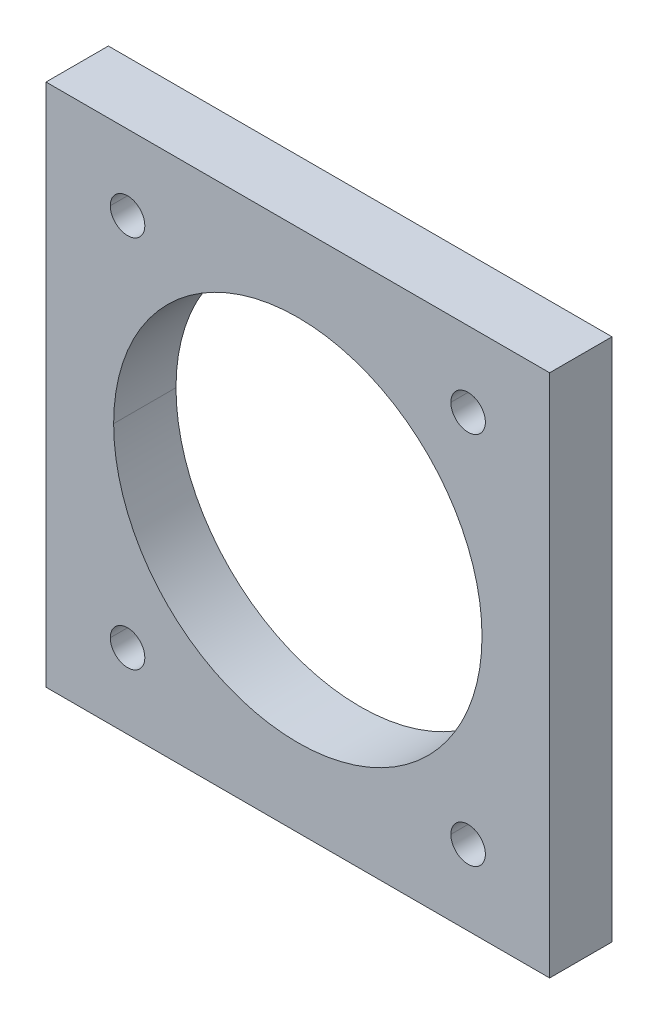
ISO-10303-21;
HEADER;
FILE_DESCRIPTION(('STEP AP214'),'2;1');
FILE_NAME('part.step','',(''),(''),'','','');
FILE_SCHEMA(('AUTOMOTIVE_DESIGN { 1 0 10303 214 1 1 1 1 }'));
ENDSEC;
DATA;
#1=APPLICATION_CONTEXT('core data for automotive mechanical design processes');
#2=APPLICATION_PROTOCOL_DEFINITION('international standard','automotive_design',2000,#1);
#3=PRODUCT_CONTEXT('',#1,'mechanical');
#4=PRODUCT('Part','Part','',(#3));
#5=PRODUCT_RELATED_PRODUCT_CATEGORY('part','',(#4));
#6=PRODUCT_DEFINITION_FORMATION('','',#4);
#7=PRODUCT_DEFINITION_CONTEXT('part definition',#1,'design');
#8=PRODUCT_DEFINITION('design','',#6,#7);
#9=PRODUCT_DEFINITION_SHAPE('','',#8);
#10=(LENGTH_UNIT() NAMED_UNIT(*) SI_UNIT(.MILLI.,.METRE.));
#11=(NAMED_UNIT(*) PLANE_ANGLE_UNIT() SI_UNIT($,.RADIAN.));
#12=(NAMED_UNIT(*) SI_UNIT($,.STERADIAN.) SOLID_ANGLE_UNIT());
#13=UNCERTAINTY_MEASURE_WITH_UNIT(LENGTH_MEASURE(1.E-05),#10,'distance_accuracy_value','');
#14=(GEOMETRIC_REPRESENTATION_CONTEXT(3) GLOBAL_UNCERTAINTY_ASSIGNED_CONTEXT((#13)) GLOBAL_UNIT_ASSIGNED_CONTEXT((#10,
#11,#12)) REPRESENTATION_CONTEXT('',''));
#15=CARTESIAN_POINT('',(0.,0.,0.));
#16=DIRECTION('',(0.,0.,1.));
#17=DIRECTION('',(1.,0.,0.));
#18=AXIS2_PLACEMENT_3D('',#15,#16,#17);
#19=CARTESIAN_POINT('',(0.,0.,0.));
#20=DIRECTION('',(0.,0.,1.));
#21=DIRECTION('',(1.,0.,0.));
#22=AXIS2_PLACEMENT_3D('',#19,#20,#21);
#23=PLANE('',#22);
#24=DIRECTION('',(0.,-1.,0.));
#25=VECTOR('',#24,1.);
#26=CARTESIAN_POINT('',(0.,1387.856,0.));
#27=LINE('',#26,#25);
#28=CARTESIAN_POINT('',(0.,1387.856,0.));
#29=VERTEX_POINT('',#28);
#30=CARTESIAN_POINT('',(0.,0.,0.));
#31=VERTEX_POINT('',#30);
#32=EDGE_CURVE('E27',#29,#31,#27,.T.);
#33=ORIENTED_EDGE('',*,*,#32,.F.);
#34=DIRECTION('',(-1.,0.,0.));
#35=VECTOR('',#34,1.);
#36=CARTESIAN_POINT('',(1333.5,1387.856,0.));
#37=LINE('',#36,#35);
#38=CARTESIAN_POINT('',(1333.5,1387.856,0.));
#39=VERTEX_POINT('',#38);
#40=EDGE_CURVE('E36',#39,#29,#37,.T.);
#41=ORIENTED_EDGE('',*,*,#40,.F.);
#42=DIRECTION('',(0.,1.,0.));
#43=VECTOR('',#42,1.);
#44=CARTESIAN_POINT('',(1333.5,0.,0.));
#45=LINE('',#44,#43);
#46=CARTESIAN_POINT('',(1333.5,0.,0.));
#47=VERTEX_POINT('',#46);
#48=EDGE_CURVE('E219',#47,#39,#45,.T.);
#49=ORIENTED_EDGE('',*,*,#48,.F.);
#50=DIRECTION('',(1.,0.,0.));
#51=VECTOR('',#50,1.);
#52=CARTESIAN_POINT('',(0.,0.,0.));
#53=LINE('',#52,#51);
#54=EDGE_CURVE('E163',#31,#47,#53,.T.);
#55=ORIENTED_EDGE('',*,*,#54,.F.);
#56=EDGE_LOOP('',(#33,#41,#49,#55));
#57=FACE_BOUND('',#56,.T.);
#58=CARTESIAN_POINT('',(215.9,198.628,0.));
#59=DIRECTION('',(0.,0.,-1.));
#60=DIRECTION('',(-1.,0.,0.));
#61=AXIS2_PLACEMENT_3D('',#58,#59,#60);
#62=CIRCLE('',#61,45.72);
#63=CARTESIAN_POINT('',(170.18,198.628,0.));
#64=VERTEX_POINT('',#63);
#65=CARTESIAN_POINT('',(261.62,198.628,0.));
#66=VERTEX_POINT('',#65);
#67=EDGE_CURVE('E164',#64,#66,#62,.T.);
#68=ORIENTED_EDGE('',*,*,#67,.F.);
#69=CARTESIAN_POINT('',(215.9,198.628,0.));
#70=DIRECTION('',(0.,0.,-1.));
#71=DIRECTION('',(1.,0.,0.));
#72=AXIS2_PLACEMENT_3D('',#69,#70,#71);
#73=CIRCLE('',#72,45.72);
#74=EDGE_CURVE('E194',#66,#64,#73,.T.);
#75=ORIENTED_EDGE('',*,*,#74,.F.);
#76=EDGE_LOOP('',(#68,#75));
#77=FACE_BOUND('',#76,.T.);
#78=CARTESIAN_POINT('',(1117.6,198.628,0.));
#79=DIRECTION('',(0.,0.,-1.));
#80=DIRECTION('',(-1.,0.,0.));
#81=AXIS2_PLACEMENT_3D('',#78,#79,#80);
#82=CIRCLE('',#81,45.72);
#83=CARTESIAN_POINT('',(1071.88,198.628,0.));
#84=VERTEX_POINT('',#83);
#85=CARTESIAN_POINT('',(1163.32,198.628,0.));
#86=VERTEX_POINT('',#85);
#87=EDGE_CURVE('E154',#84,#86,#82,.T.);
#88=ORIENTED_EDGE('',*,*,#87,.F.);
#89=CARTESIAN_POINT('',(1117.6,198.628,0.));
#90=DIRECTION('',(0.,0.,-1.));
#91=DIRECTION('',(1.,0.,0.));
#92=AXIS2_PLACEMENT_3D('',#89,#90,#91);
#93=CIRCLE('',#92,45.72);
#94=EDGE_CURVE('E197',#86,#84,#93,.T.);
#95=ORIENTED_EDGE('',*,*,#94,.F.);
#96=EDGE_LOOP('',(#88,#95));
#97=FACE_BOUND('',#96,.T.);
#98=CARTESIAN_POINT('',(1117.6,1189.228,0.));
#99=DIRECTION('',(0.,0.,-1.));
#100=DIRECTION('',(-1.,0.,0.));
#101=AXIS2_PLACEMENT_3D('',#98,#99,#100);
#102=CIRCLE('',#101,45.72);
#103=CARTESIAN_POINT('',(1071.88,1189.228,0.));
#104=VERTEX_POINT('',#103);
#105=CARTESIAN_POINT('',(1163.32,1189.228,0.));
#106=VERTEX_POINT('',#105);
#107=EDGE_CURVE('E177',#104,#106,#102,.T.);
#108=ORIENTED_EDGE('',*,*,#107,.F.);
#109=CARTESIAN_POINT('',(1117.6,1189.228,0.));
#110=DIRECTION('',(0.,0.,-1.));
#111=DIRECTION('',(1.,0.,0.));
#112=AXIS2_PLACEMENT_3D('',#109,#110,#111);
#113=CIRCLE('',#112,45.72);
#114=EDGE_CURVE('E126',#106,#104,#113,.T.);
#115=ORIENTED_EDGE('',*,*,#114,.F.);
#116=EDGE_LOOP('',(#108,#115));
#117=FACE_BOUND('',#116,.T.);
#118=CARTESIAN_POINT('',(215.9,1189.228,0.));
#119=DIRECTION('',(0.,0.,-1.));
#120=DIRECTION('',(-1.,0.,0.));
#121=AXIS2_PLACEMENT_3D('',#118,#119,#120);
#122=CIRCLE('',#121,45.72);
#123=CARTESIAN_POINT('',(170.18,1189.228,0.));
#124=VERTEX_POINT('',#123);
#125=CARTESIAN_POINT('',(261.62,1189.228,0.));
#126=VERTEX_POINT('',#125);
#127=EDGE_CURVE('E107',#124,#126,#122,.T.);
#128=ORIENTED_EDGE('',*,*,#127,.F.);
#129=CARTESIAN_POINT('',(215.9,1189.228,0.));
#130=DIRECTION('',(0.,0.,-1.));
#131=DIRECTION('',(1.,0.,0.));
#132=AXIS2_PLACEMENT_3D('',#129,#130,#131);
#133=CIRCLE('',#132,45.72);
#134=EDGE_CURVE('E104',#126,#124,#133,.T.);
#135=ORIENTED_EDGE('',*,*,#134,.F.);
#136=EDGE_LOOP('',(#128,#135));
#137=FACE_BOUND('',#136,.T.);
#138=CARTESIAN_POINT('',(666.75,693.928,0.));
#139=DIRECTION('',(0.,0.,-1.));
#140=DIRECTION('',(-1.,0.,0.));
#141=AXIS2_PLACEMENT_3D('',#138,#139,#140);
#142=CIRCLE('',#141,487.68);
#143=CARTESIAN_POINT('',(179.07,693.928,0.));
#144=VERTEX_POINT('',#143);
#145=CARTESIAN_POINT('',(1154.43,693.928,0.));
#146=VERTEX_POINT('',#145);
#147=EDGE_CURVE('E149',#144,#146,#142,.T.);
#148=ORIENTED_EDGE('',*,*,#147,.F.);
#149=CARTESIAN_POINT('',(666.75,693.928,0.));
#150=DIRECTION('',(0.,0.,-1.));
#151=DIRECTION('',(1.,0.,0.));
#152=AXIS2_PLACEMENT_3D('',#149,#150,#151);
#153=CIRCLE('',#152,487.68);
#154=EDGE_CURVE('E189',#146,#144,#153,.T.);
#155=ORIENTED_EDGE('',*,*,#154,.F.);
#156=EDGE_LOOP('',(#148,#155));
#157=FACE_BOUND('',#156,.T.);
#158=ADVANCED_FACE('F16',(#57,#77,#97,#117,#137,#157),#23,.F.);
#159=CARTESIAN_POINT('',(0.,1387.856,0.));
#160=DIRECTION('',(-1.,0.,0.));
#161=DIRECTION('',(0.,-1.,0.));
#162=AXIS2_PLACEMENT_3D('',#159,#160,#161);
#163=PLANE('',#162);
#164=DIRECTION('',(0.,0.,1.));
#165=VECTOR('',#164,1.);
#166=CARTESIAN_POINT('',(0.,0.,0.));
#167=LINE('',#166,#165);
#168=CARTESIAN_POINT('',(0.,0.,165.1));
#169=VERTEX_POINT('',#168);
#170=EDGE_CURVE('E10',#31,#169,#167,.T.);
#171=ORIENTED_EDGE('',*,*,#170,.T.);
#172=DIRECTION('',(0.,-1.,0.));
#173=VECTOR('',#172,1.);
#174=CARTESIAN_POINT('',(0.,1387.856,165.1));
#175=LINE('',#174,#173);
#176=CARTESIAN_POINT('',(0.,1387.856,165.1));
#177=VERTEX_POINT('',#176);
#178=EDGE_CURVE('E211',#177,#169,#175,.T.);
#179=ORIENTED_EDGE('',*,*,#178,.F.);
#180=DIRECTION('',(0.,0.,1.));
#181=VECTOR('',#180,1.);
#182=CARTESIAN_POINT('',(0.,1387.856,0.));
#183=LINE('',#182,#181);
#184=EDGE_CURVE('E144',#29,#177,#183,.T.);
#185=ORIENTED_EDGE('',*,*,#184,.F.);
#186=ORIENTED_EDGE('',*,*,#32,.T.);
#187=EDGE_LOOP('',(#171,#179,#185,#186));
#188=FACE_BOUND('',#187,.T.);
#189=ADVANCED_FACE('F302',(#188),#163,.T.);
#190=CARTESIAN_POINT('',(1333.5,1387.856,0.));
#191=DIRECTION('',(0.,1.,0.));
#192=DIRECTION('',(-1.,0.,0.));
#193=AXIS2_PLACEMENT_3D('',#190,#191,#192);
#194=PLANE('',#193);
#195=ORIENTED_EDGE('',*,*,#184,.T.);
#196=DIRECTION('',(-1.,0.,0.));
#197=VECTOR('',#196,1.);
#198=CARTESIAN_POINT('',(1333.5,1387.856,165.1));
#199=LINE('',#198,#197);
#200=CARTESIAN_POINT('',(1333.5,1387.856,165.1));
#201=VERTEX_POINT('',#200);
#202=EDGE_CURVE('E207',#201,#177,#199,.T.);
#203=ORIENTED_EDGE('',*,*,#202,.F.);
#204=DIRECTION('',(0.,0.,1.));
#205=VECTOR('',#204,1.);
#206=CARTESIAN_POINT('',(1333.5,1387.856,0.));
#207=LINE('',#206,#205);
#208=EDGE_CURVE('E20',#39,#201,#207,.T.);
#209=ORIENTED_EDGE('',*,*,#208,.F.);
#210=ORIENTED_EDGE('',*,*,#40,.T.);
#211=EDGE_LOOP('',(#195,#203,#209,#210));
#212=FACE_BOUND('',#211,.T.);
#213=ADVANCED_FACE('F305',(#212),#194,.T.);
#214=CARTESIAN_POINT('',(1333.5,0.,0.));
#215=DIRECTION('',(1.,0.,0.));
#216=DIRECTION('',(0.,1.,0.));
#217=AXIS2_PLACEMENT_3D('',#214,#215,#216);
#218=PLANE('',#217);
#219=ORIENTED_EDGE('',*,*,#208,.T.);
#220=DIRECTION('',(0.,1.,0.));
#221=VECTOR('',#220,1.);
#222=CARTESIAN_POINT('',(1333.5,0.,165.1));
#223=LINE('',#222,#221);
#224=CARTESIAN_POINT('',(1333.5,0.,165.1));
#225=VERTEX_POINT('',#224);
#226=EDGE_CURVE('E206',#225,#201,#223,.T.);
#227=ORIENTED_EDGE('',*,*,#226,.F.);
#228=DIRECTION('',(0.,0.,1.));
#229=VECTOR('',#228,1.);
#230=CARTESIAN_POINT('',(1333.5,0.,0.));
#231=LINE('',#230,#229);
#232=EDGE_CURVE('E215',#47,#225,#231,.T.);
#233=ORIENTED_EDGE('',*,*,#232,.F.);
#234=ORIENTED_EDGE('',*,*,#48,.T.);
#235=EDGE_LOOP('',(#219,#227,#233,#234));
#236=FACE_BOUND('',#235,.T.);
#237=ADVANCED_FACE('F306',(#236),#218,.T.);
#238=CARTESIAN_POINT('',(0.,0.,0.));
#239=DIRECTION('',(0.,-1.,0.));
#240=DIRECTION('',(1.,0.,0.));
#241=AXIS2_PLACEMENT_3D('',#238,#239,#240);
#242=PLANE('',#241);
#243=ORIENTED_EDGE('',*,*,#232,.T.);
#244=DIRECTION('',(1.,0.,0.));
#245=VECTOR('',#244,1.);
#246=CARTESIAN_POINT('',(0.,0.,165.1));
#247=LINE('',#246,#245);
#248=EDGE_CURVE('E247',#169,#225,#247,.T.);
#249=ORIENTED_EDGE('',*,*,#248,.F.);
#250=ORIENTED_EDGE('',*,*,#170,.F.);
#251=ORIENTED_EDGE('',*,*,#54,.T.);
#252=EDGE_LOOP('',(#243,#249,#250,#251));
#253=FACE_BOUND('',#252,.T.);
#254=ADVANCED_FACE('F308',(#253),#242,.T.);
#255=CARTESIAN_POINT('',(215.9,198.628,0.));
#256=DIRECTION('',(0.,0.,-1.));
#257=DIRECTION('',(1.,0.,0.));
#258=AXIS2_PLACEMENT_3D('',#255,#256,#257);
#259=CYLINDRICAL_SURFACE('',#258,45.72);
#260=DIRECTION('',(0.,0.,1.));
#261=VECTOR('',#260,1.);
#262=CARTESIAN_POINT('',(261.62,198.628,0.));
#263=LINE('',#262,#261);
#264=CARTESIAN_POINT('',(261.62,198.628,165.1));
#265=VERTEX_POINT('',#264);
#266=EDGE_CURVE('E160',#66,#265,#263,.T.);
#267=ORIENTED_EDGE('',*,*,#266,.T.);
#268=CARTESIAN_POINT('',(215.9,198.628,165.1));
#269=DIRECTION('',(0.,0.,-1.));
#270=DIRECTION('',(-1.,0.,0.));
#271=AXIS2_PLACEMENT_3D('',#268,#269,#270);
#272=CIRCLE('',#271,45.72);
#273=CARTESIAN_POINT('',(170.18,198.628,165.1));
#274=VERTEX_POINT('',#273);
#275=EDGE_CURVE('E90',#274,#265,#272,.T.);
#276=ORIENTED_EDGE('',*,*,#275,.F.);
#277=DIRECTION('',(0.,0.,1.));
#278=VECTOR('',#277,1.);
#279=CARTESIAN_POINT('',(170.18,198.628,0.));
#280=LINE('',#279,#278);
#281=EDGE_CURVE('E138',#64,#274,#280,.T.);
#282=ORIENTED_EDGE('',*,*,#281,.F.);
#283=ORIENTED_EDGE('',*,*,#67,.T.);
#284=EDGE_LOOP('',(#267,#276,#282,#283));
#285=FACE_BOUND('',#284,.T.);
#286=ADVANCED_FACE('F349',(#285),#259,.F.);
#287=CARTESIAN_POINT('',(215.9,198.628,0.));
#288=DIRECTION('',(0.,0.,-1.));
#289=DIRECTION('',(1.,0.,0.));
#290=AXIS2_PLACEMENT_3D('',#287,#288,#289);
#291=CYLINDRICAL_SURFACE('',#290,45.72);
#292=ORIENTED_EDGE('',*,*,#281,.T.);
#293=CARTESIAN_POINT('',(215.9,198.628,165.1));
#294=DIRECTION('',(0.,0.,-1.));
#295=DIRECTION('',(1.,0.,0.));
#296=AXIS2_PLACEMENT_3D('',#293,#294,#295);
#297=CIRCLE('',#296,45.72);
#298=EDGE_CURVE('E165',#265,#274,#297,.T.);
#299=ORIENTED_EDGE('',*,*,#298,.F.);
#300=ORIENTED_EDGE('',*,*,#266,.F.);
#301=ORIENTED_EDGE('',*,*,#74,.T.);
#302=EDGE_LOOP('',(#292,#299,#300,#301));
#303=FACE_BOUND('',#302,.T.);
#304=ADVANCED_FACE('F269',(#303),#291,.F.);
#305=CARTESIAN_POINT('',(1117.6,198.628,0.));
#306=DIRECTION('',(0.,0.,-1.));
#307=DIRECTION('',(1.,0.,0.));
#308=AXIS2_PLACEMENT_3D('',#305,#306,#307);
#309=CYLINDRICAL_SURFACE('',#308,45.72);
#310=DIRECTION('',(0.,0.,1.));
#311=VECTOR('',#310,1.);
#312=CARTESIAN_POINT('',(1163.32,198.628,0.));
#313=LINE('',#312,#311);
#314=CARTESIAN_POINT('',(1163.32,198.628,165.1));
#315=VERTEX_POINT('',#314);
#316=EDGE_CURVE('E158',#86,#315,#313,.T.);
#317=ORIENTED_EDGE('',*,*,#316,.T.);
#318=CARTESIAN_POINT('',(1117.6,198.628,165.1));
#319=DIRECTION('',(0.,0.,-1.));
#320=DIRECTION('',(-1.,0.,0.));
#321=AXIS2_PLACEMENT_3D('',#318,#319,#320);
#322=CIRCLE('',#321,45.72);
#323=CARTESIAN_POINT('',(1071.88,198.628,165.1));
#324=VERTEX_POINT('',#323);
#325=EDGE_CURVE('E168',#324,#315,#322,.T.);
#326=ORIENTED_EDGE('',*,*,#325,.F.);
#327=DIRECTION('',(0.,0.,1.));
#328=VECTOR('',#327,1.);
#329=CARTESIAN_POINT('',(1071.88,198.628,0.));
#330=LINE('',#329,#328);
#331=EDGE_CURVE('E159',#84,#324,#330,.T.);
#332=ORIENTED_EDGE('',*,*,#331,.F.);
#333=ORIENTED_EDGE('',*,*,#87,.T.);
#334=EDGE_LOOP('',(#317,#326,#332,#333));
#335=FACE_BOUND('',#334,.T.);
#336=ADVANCED_FACE('F343',(#335),#309,.F.);
#337=CARTESIAN_POINT('',(1117.6,198.628,0.));
#338=DIRECTION('',(0.,0.,-1.));
#339=DIRECTION('',(1.,0.,0.));
#340=AXIS2_PLACEMENT_3D('',#337,#338,#339);
#341=CYLINDRICAL_SURFACE('',#340,45.72);
#342=ORIENTED_EDGE('',*,*,#331,.T.);
#343=CARTESIAN_POINT('',(1117.6,198.628,165.1));
#344=DIRECTION('',(0.,0.,-1.));
#345=DIRECTION('',(1.,0.,0.));
#346=AXIS2_PLACEMENT_3D('',#343,#344,#345);
#347=CIRCLE('',#346,45.72);
#348=EDGE_CURVE('E169',#315,#324,#347,.T.);
#349=ORIENTED_EDGE('',*,*,#348,.F.);
#350=ORIENTED_EDGE('',*,*,#316,.F.);
#351=ORIENTED_EDGE('',*,*,#94,.T.);
#352=EDGE_LOOP('',(#342,#349,#350,#351));
#353=FACE_BOUND('',#352,.T.);
#354=ADVANCED_FACE('F18',(#353),#341,.F.);
#355=CARTESIAN_POINT('',(1117.6,1189.228,0.));
#356=DIRECTION('',(0.,0.,-1.));
#357=DIRECTION('',(1.,0.,0.));
#358=AXIS2_PLACEMENT_3D('',#355,#356,#357);
#359=CYLINDRICAL_SURFACE('',#358,45.72);
#360=DIRECTION('',(0.,0.,1.));
#361=VECTOR('',#360,1.);
#362=CARTESIAN_POINT('',(1163.32,1189.228,0.));
#363=LINE('',#362,#361);
#364=CARTESIAN_POINT('',(1163.32,1189.228,165.1));
#365=VERTEX_POINT('',#364);
#366=EDGE_CURVE('E181',#106,#365,#363,.T.);
#367=ORIENTED_EDGE('',*,*,#366,.T.);
#368=CARTESIAN_POINT('',(1117.6,1189.228,165.1));
#369=DIRECTION('',(0.,0.,-1.));
#370=DIRECTION('',(-1.,0.,0.));
#371=AXIS2_PLACEMENT_3D('',#368,#369,#370);
#372=CIRCLE('',#371,45.72);
#373=CARTESIAN_POINT('',(1071.88,1189.228,165.1));
#374=VERTEX_POINT('',#373);
#375=EDGE_CURVE('E173',#374,#365,#372,.T.);
#376=ORIENTED_EDGE('',*,*,#375,.F.);
#377=DIRECTION('',(0.,0.,1.));
#378=VECTOR('',#377,1.);
#379=CARTESIAN_POINT('',(1071.88,1189.228,0.));
#380=LINE('',#379,#378);
#381=EDGE_CURVE('E134',#104,#374,#380,.T.);
#382=ORIENTED_EDGE('',*,*,#381,.F.);
#383=ORIENTED_EDGE('',*,*,#107,.T.);
#384=EDGE_LOOP('',(#367,#376,#382,#383));
#385=FACE_BOUND('',#384,.T.);
#386=ADVANCED_FACE('F324',(#385),#359,.F.);
#387=CARTESIAN_POINT('',(1117.6,1189.228,0.));
#388=DIRECTION('',(0.,0.,-1.));
#389=DIRECTION('',(1.,0.,0.));
#390=AXIS2_PLACEMENT_3D('',#387,#388,#389);
#391=CYLINDRICAL_SURFACE('',#390,45.72);
#392=ORIENTED_EDGE('',*,*,#381,.T.);
#393=CARTESIAN_POINT('',(1117.6,1189.228,165.1));
#394=DIRECTION('',(0.,0.,-1.));
#395=DIRECTION('',(1.,0.,0.));
#396=AXIS2_PLACEMENT_3D('',#393,#394,#395);
#397=CIRCLE('',#396,45.72);
#398=EDGE_CURVE('E143',#365,#374,#397,.T.);
#399=ORIENTED_EDGE('',*,*,#398,.F.);
#400=ORIENTED_EDGE('',*,*,#366,.F.);
#401=ORIENTED_EDGE('',*,*,#114,.T.);
#402=EDGE_LOOP('',(#392,#399,#400,#401));
#403=FACE_BOUND('',#402,.T.);
#404=ADVANCED_FACE('F330',(#403),#391,.F.);
#405=CARTESIAN_POINT('',(215.9,1189.228,0.));
#406=DIRECTION('',(0.,0.,-1.));
#407=DIRECTION('',(1.,0.,0.));
#408=AXIS2_PLACEMENT_3D('',#405,#406,#407);
#409=CYLINDRICAL_SURFACE('',#408,45.72);
#410=DIRECTION('',(0.,0.,1.));
#411=VECTOR('',#410,1.);
#412=CARTESIAN_POINT('',(261.62,1189.228,0.));
#413=LINE('',#412,#411);
#414=CARTESIAN_POINT('',(261.62,1189.228,165.1));
#415=VERTEX_POINT('',#414);
#416=EDGE_CURVE('E119',#126,#415,#413,.T.);
#417=ORIENTED_EDGE('',*,*,#416,.T.);
#418=CARTESIAN_POINT('',(215.9,1189.228,165.1));
#419=DIRECTION('',(0.,0.,-1.));
#420=DIRECTION('',(-1.,0.,0.));
#421=AXIS2_PLACEMENT_3D('',#418,#419,#420);
#422=CIRCLE('',#421,45.72);
#423=CARTESIAN_POINT('',(170.18,1189.228,165.1));
#424=VERTEX_POINT('',#423);
#425=EDGE_CURVE('E140',#424,#415,#422,.T.);
#426=ORIENTED_EDGE('',*,*,#425,.F.);
#427=DIRECTION('',(0.,0.,1.));
#428=VECTOR('',#427,1.);
#429=CARTESIAN_POINT('',(170.18,1189.228,0.));
#430=LINE('',#429,#428);
#431=EDGE_CURVE('E113',#124,#424,#430,.T.);
#432=ORIENTED_EDGE('',*,*,#431,.F.);
#433=ORIENTED_EDGE('',*,*,#127,.T.);
#434=EDGE_LOOP('',(#417,#426,#432,#433));
#435=FACE_BOUND('',#434,.T.);
#436=ADVANCED_FACE('F118',(#435),#409,.F.);
#437=CARTESIAN_POINT('',(215.9,1189.228,0.));
#438=DIRECTION('',(0.,0.,-1.));
#439=DIRECTION('',(1.,0.,0.));
#440=AXIS2_PLACEMENT_3D('',#437,#438,#439);
#441=CYLINDRICAL_SURFACE('',#440,45.72);
#442=ORIENTED_EDGE('',*,*,#431,.T.);
#443=CARTESIAN_POINT('',(215.9,1189.228,165.1));
#444=DIRECTION('',(0.,0.,-1.));
#445=DIRECTION('',(1.,0.,0.));
#446=AXIS2_PLACEMENT_3D('',#443,#444,#445);
#447=CIRCLE('',#446,45.72);
#448=EDGE_CURVE('E124',#415,#424,#447,.T.);
#449=ORIENTED_EDGE('',*,*,#448,.F.);
#450=ORIENTED_EDGE('',*,*,#416,.F.);
#451=ORIENTED_EDGE('',*,*,#134,.T.);
#452=EDGE_LOOP('',(#442,#449,#450,#451));
#453=FACE_BOUND('',#452,.T.);
#454=ADVANCED_FACE('F122',(#453),#441,.F.);
#455=CARTESIAN_POINT('',(666.75,693.928,0.));
#456=DIRECTION('',(0.,0.,-1.));
#457=DIRECTION('',(1.,0.,0.));
#458=AXIS2_PLACEMENT_3D('',#455,#456,#457);
#459=CYLINDRICAL_SURFACE('',#458,487.68);
#460=DIRECTION('',(0.,0.,1.));
#461=VECTOR('',#460,1.);
#462=CARTESIAN_POINT('',(1154.43,693.928,0.));
#463=LINE('',#462,#461);
#464=CARTESIAN_POINT('',(1154.43,693.928,165.1));
#465=VERTEX_POINT('',#464);
#466=EDGE_CURVE('E114',#146,#465,#463,.T.);
#467=ORIENTED_EDGE('',*,*,#466,.T.);
#468=CARTESIAN_POINT('',(666.75,693.928,165.1));
#469=DIRECTION('',(0.,0.,-1.));
#470=DIRECTION('',(-1.,0.,0.));
#471=AXIS2_PLACEMENT_3D('',#468,#469,#470);
#472=CIRCLE('',#471,487.68);
#473=CARTESIAN_POINT('',(179.07,693.928,165.1));
#474=VERTEX_POINT('',#473);
#475=EDGE_CURVE('E184',#474,#465,#472,.T.);
#476=ORIENTED_EDGE('',*,*,#475,.F.);
#477=DIRECTION('',(0.,0.,1.));
#478=VECTOR('',#477,1.);
#479=CARTESIAN_POINT('',(179.07,693.928,0.));
#480=LINE('',#479,#478);
#481=EDGE_CURVE('E185',#144,#474,#480,.T.);
#482=ORIENTED_EDGE('',*,*,#481,.F.);
#483=ORIENTED_EDGE('',*,*,#147,.T.);
#484=EDGE_LOOP('',(#467,#476,#482,#483));
#485=FACE_BOUND('',#484,.T.);
#486=ADVANCED_FACE('F286',(#485),#459,.F.);
#487=CARTESIAN_POINT('',(666.75,693.928,0.));
#488=DIRECTION('',(0.,0.,-1.));
#489=DIRECTION('',(1.,0.,0.));
#490=AXIS2_PLACEMENT_3D('',#487,#488,#489);
#491=CYLINDRICAL_SURFACE('',#490,487.68);
#492=ORIENTED_EDGE('',*,*,#481,.T.);
#493=CARTESIAN_POINT('',(666.75,693.928,165.1));
#494=DIRECTION('',(0.,0.,-1.));
#495=DIRECTION('',(1.,0.,0.));
#496=AXIS2_PLACEMENT_3D('',#493,#494,#495);
#497=CIRCLE('',#496,487.68);
#498=EDGE_CURVE('E190',#465,#474,#497,.T.);
#499=ORIENTED_EDGE('',*,*,#498,.F.);
#500=ORIENTED_EDGE('',*,*,#466,.F.);
#501=ORIENTED_EDGE('',*,*,#154,.T.);
#502=EDGE_LOOP('',(#492,#499,#500,#501));
#503=FACE_BOUND('',#502,.T.);
#504=ADVANCED_FACE('F273',(#503),#491,.F.);
#505=CARTESIAN_POINT('',(0.,0.,165.1));
#506=DIRECTION('',(0.,0.,1.));
#507=DIRECTION('',(1.,0.,0.));
#508=AXIS2_PLACEMENT_3D('',#505,#506,#507);
#509=PLANE('',#508);
#510=ORIENTED_EDGE('',*,*,#226,.T.);
#511=ORIENTED_EDGE('',*,*,#202,.T.);
#512=ORIENTED_EDGE('',*,*,#178,.T.);
#513=ORIENTED_EDGE('',*,*,#248,.T.);
#514=EDGE_LOOP('',(#510,#511,#512,#513));
#515=FACE_BOUND('',#514,.T.);
#516=ORIENTED_EDGE('',*,*,#275,.T.);
#517=ORIENTED_EDGE('',*,*,#298,.T.);
#518=EDGE_LOOP('',(#516,#517));
#519=FACE_BOUND('',#518,.T.);
#520=ORIENTED_EDGE('',*,*,#325,.T.);
#521=ORIENTED_EDGE('',*,*,#348,.T.);
#522=EDGE_LOOP('',(#520,#521));
#523=FACE_BOUND('',#522,.T.);
#524=ORIENTED_EDGE('',*,*,#375,.T.);
#525=ORIENTED_EDGE('',*,*,#398,.T.);
#526=EDGE_LOOP('',(#524,#525));
#527=FACE_BOUND('',#526,.T.);
#528=ORIENTED_EDGE('',*,*,#425,.T.);
#529=ORIENTED_EDGE('',*,*,#448,.T.);
#530=EDGE_LOOP('',(#528,#529));
#531=FACE_BOUND('',#530,.T.);
#532=ORIENTED_EDGE('',*,*,#475,.T.);
#533=ORIENTED_EDGE('',*,*,#498,.T.);
#534=EDGE_LOOP('',(#532,#533));
#535=FACE_BOUND('',#534,.T.);
#536=ADVANCED_FACE('F270',(#515,#519,#523,#527,#531,#535),#509,.T.);
#537=CLOSED_SHELL('',(#158,#189,#213,#237,#254,#286,#304,#336,#354,#386,#404,#436,#454,#486,
#504,#536));
#538=MANIFOLD_SOLID_BREP('B1',#537);
#539=ADVANCED_BREP_SHAPE_REPRESENTATION('',(#18,#538),#14);
#540=SHAPE_DEFINITION_REPRESENTATION(#9,#539);
ENDSEC;
END-ISO-10303-21;
